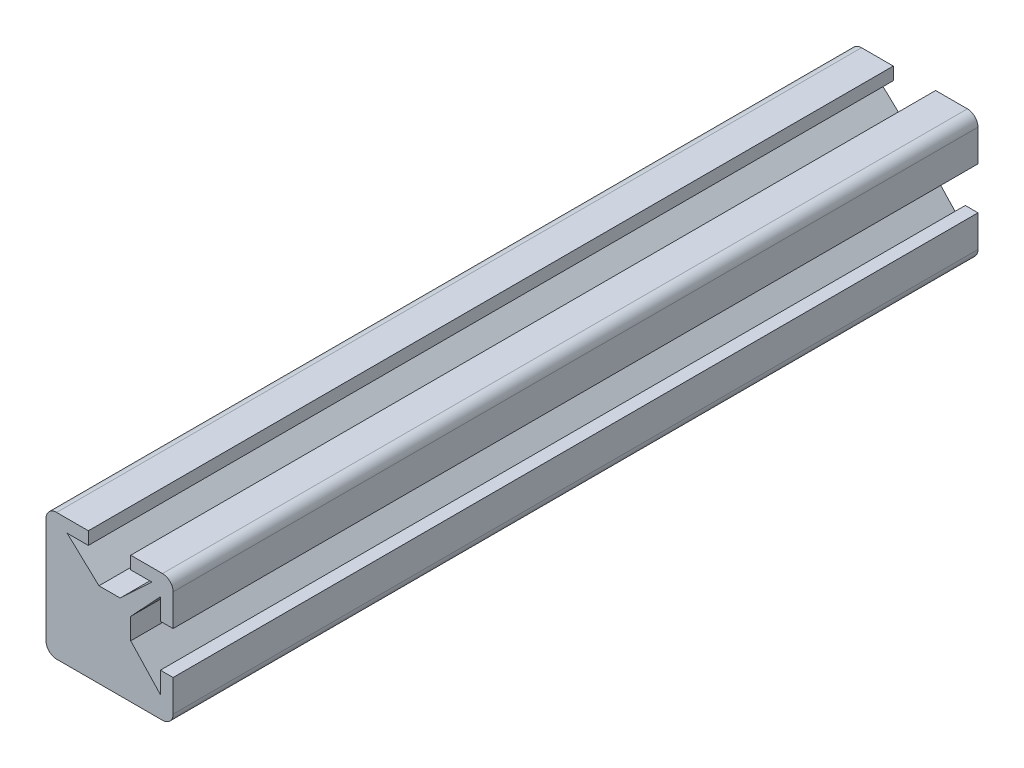
ISO-10303-21;
HEADER;
FILE_DESCRIPTION(('STEP AP214'),'2;1');
FILE_NAME('part.step','',(''),(''),'','','');
FILE_SCHEMA(('AUTOMOTIVE_DESIGN { 1 0 10303 214 1 1 1 1 }'));
ENDSEC;
DATA;
#1=APPLICATION_CONTEXT('core data for automotive mechanical design processes');
#2=APPLICATION_PROTOCOL_DEFINITION('international standard','automotive_design',2000,#1);
#3=PRODUCT_CONTEXT('',#1,'mechanical');
#4=PRODUCT('Part','Part','',(#3));
#5=PRODUCT_RELATED_PRODUCT_CATEGORY('part','',(#4));
#6=PRODUCT_DEFINITION_FORMATION('','',#4);
#7=PRODUCT_DEFINITION_CONTEXT('part definition',#1,'design');
#8=PRODUCT_DEFINITION('design','',#6,#7);
#9=PRODUCT_DEFINITION_SHAPE('','',#8);
#10=(LENGTH_UNIT() NAMED_UNIT(*) SI_UNIT(.MILLI.,.METRE.));
#11=(NAMED_UNIT(*) PLANE_ANGLE_UNIT() SI_UNIT($,.RADIAN.));
#12=(NAMED_UNIT(*) SI_UNIT($,.STERADIAN.) SOLID_ANGLE_UNIT());
#13=UNCERTAINTY_MEASURE_WITH_UNIT(LENGTH_MEASURE(1.E-05),#10,'distance_accuracy_value','');
#14=(GEOMETRIC_REPRESENTATION_CONTEXT(3) GLOBAL_UNCERTAINTY_ASSIGNED_CONTEXT((#13)) GLOBAL_UNIT_ASSIGNED_CONTEXT((#10,
#11,#12)) REPRESENTATION_CONTEXT('',''));
#15=CARTESIAN_POINT('',(0.,0.,0.));
#16=DIRECTION('',(0.,0.,1.));
#17=DIRECTION('',(1.,0.,0.));
#18=AXIS2_PLACEMENT_3D('',#15,#16,#17);
#19=CARTESIAN_POINT('',(-5.,6.,38.));
#20=DIRECTION('',(0.,-1.,0.));
#21=DIRECTION('',(0.,0.,-1.));
#22=AXIS2_PLACEMENT_3D('',#19,#20,#21);
#23=PLANE('',#22);
#24=DIRECTION('',(-1.,0.,0.));
#25=VECTOR('',#24,1.);
#26=CARTESIAN_POINT('',(-5.,6.,-38.));
#27=LINE('',#26,#25);
#28=CARTESIAN_POINT('',(5.,6.,-38.));
#29=VERTEX_POINT('',#28);
#30=CARTESIAN_POINT('',(1.99999999999998,6.00000000000001,-38.));
#31=VERTEX_POINT('',#30);
#32=EDGE_CURVE('E217',#29,#31,#27,.T.);
#33=ORIENTED_EDGE('',*,*,#32,.T.);
#34=DIRECTION('',(0.,0.,1.));
#35=VECTOR('',#34,1.);
#36=CARTESIAN_POINT('',(1.99999999999998,6.00000000000001,-38.));
#37=LINE('',#36,#35);
#38=CARTESIAN_POINT('',(1.99999999999998,6.00000000000001,38.));
#39=VERTEX_POINT('',#38);
#40=EDGE_CURVE('E385',#31,#39,#37,.T.);
#41=ORIENTED_EDGE('',*,*,#40,.T.);
#42=DIRECTION('',(-1.,0.,0.));
#43=VECTOR('',#42,1.);
#44=CARTESIAN_POINT('',(-5.,6.,38.));
#45=LINE('',#44,#43);
#46=CARTESIAN_POINT('',(5.,6.,38.));
#47=VERTEX_POINT('',#46);
#48=EDGE_CURVE('E282',#47,#39,#45,.T.);
#49=ORIENTED_EDGE('',*,*,#48,.F.);
#50=DIRECTION('',(0.,0.,-1.));
#51=VECTOR('',#50,1.);
#52=CARTESIAN_POINT('',(5.,6.,38.));
#53=LINE('',#52,#51);
#54=EDGE_CURVE('E238',#47,#29,#53,.T.);
#55=ORIENTED_EDGE('',*,*,#54,.T.);
#56=EDGE_LOOP('',(#33,#41,#49,#55));
#57=FACE_BOUND('',#56,.T.);
#58=ADVANCED_FACE('F32',(#57),#23,.F.);
#59=CARTESIAN_POINT('',(6.,5.,38.));
#60=DIRECTION('',(-1.,0.,0.));
#61=DIRECTION('',(0.,0.,1.));
#62=AXIS2_PLACEMENT_3D('',#59,#60,#61);
#63=PLANE('',#62);
#64=DIRECTION('',(0.,1.,0.));
#65=VECTOR('',#64,1.);
#66=CARTESIAN_POINT('',(6.,5.,-38.));
#67=LINE('',#66,#65);
#68=CARTESIAN_POINT('',(6.,-5.,-38.));
#69=VERTEX_POINT('',#68);
#70=CARTESIAN_POINT('',(6.,-2.,-38.));
#71=VERTEX_POINT('',#70);
#72=EDGE_CURVE('E221',#69,#71,#67,.T.);
#73=ORIENTED_EDGE('',*,*,#72,.T.);
#74=DIRECTION('',(0.,0.,1.));
#75=VECTOR('',#74,1.);
#76=CARTESIAN_POINT('',(6.,-2.,-38.));
#77=LINE('',#76,#75);
#78=CARTESIAN_POINT('',(6.,-2.,38.));
#79=VERTEX_POINT('',#78);
#80=EDGE_CURVE('E270',#71,#79,#77,.T.);
#81=ORIENTED_EDGE('',*,*,#80,.T.);
#82=DIRECTION('',(0.,1.,0.));
#83=VECTOR('',#82,1.);
#84=CARTESIAN_POINT('',(6.,5.,38.));
#85=LINE('',#84,#83);
#86=CARTESIAN_POINT('',(6.,-5.,38.));
#87=VERTEX_POINT('',#86);
#88=EDGE_CURVE('E272',#87,#79,#85,.T.);
#89=ORIENTED_EDGE('',*,*,#88,.F.);
#90=DIRECTION('',(0.,0.,-1.));
#91=VECTOR('',#90,1.);
#92=CARTESIAN_POINT('',(6.,-5.,38.));
#93=LINE('',#92,#91);
#94=EDGE_CURVE('E244',#87,#69,#93,.T.);
#95=ORIENTED_EDGE('',*,*,#94,.T.);
#96=EDGE_LOOP('',(#73,#81,#89,#95));
#97=FACE_BOUND('',#96,.T.);
#98=ADVANCED_FACE('F268',(#97),#63,.F.);
#99=CARTESIAN_POINT('',(-5.,-5.,38.));
#100=DIRECTION('',(0.,0.,-1.));
#101=DIRECTION('',(-1.,0.,0.));
#102=AXIS2_PLACEMENT_3D('',#99,#100,#101);
#103=CYLINDRICAL_SURFACE('',#102,1.);
#104=CARTESIAN_POINT('',(-5.,-5.,-38.));
#105=DIRECTION('',(0.,0.,1.));
#106=DIRECTION('',(-1.,0.,0.));
#107=AXIS2_PLACEMENT_3D('',#104,#105,#106);
#108=CIRCLE('',#107,1.);
#109=CARTESIAN_POINT('',(-6.,-5.,-38.));
#110=VERTEX_POINT('',#109);
#111=CARTESIAN_POINT('',(-5.,-6.,-38.));
#112=VERTEX_POINT('',#111);
#113=EDGE_CURVE('E263',#110,#112,#108,.T.);
#114=ORIENTED_EDGE('',*,*,#113,.T.);
#115=DIRECTION('',(0.,0.,-1.));
#116=VECTOR('',#115,1.);
#117=CARTESIAN_POINT('',(-5.,-6.,38.));
#118=LINE('',#117,#116);
#119=CARTESIAN_POINT('',(-5.,-6.,38.));
#120=VERTEX_POINT('',#119);
#121=EDGE_CURVE('E11',#120,#112,#118,.T.);
#122=ORIENTED_EDGE('',*,*,#121,.F.);
#123=CARTESIAN_POINT('',(-5.,-5.,38.));
#124=DIRECTION('',(0.,0.,1.));
#125=DIRECTION('',(-1.,0.,0.));
#126=AXIS2_PLACEMENT_3D('',#123,#124,#125);
#127=CIRCLE('',#126,1.);
#128=CARTESIAN_POINT('',(-6.,-5.,38.));
#129=VERTEX_POINT('',#128);
#130=EDGE_CURVE('E228',#129,#120,#127,.T.);
#131=ORIENTED_EDGE('',*,*,#130,.F.);
#132=DIRECTION('',(0.,0.,-1.));
#133=VECTOR('',#132,1.);
#134=CARTESIAN_POINT('',(-6.,-5.,38.));
#135=LINE('',#134,#133);
#136=EDGE_CURVE('E229',#129,#110,#135,.T.);
#137=ORIENTED_EDGE('',*,*,#136,.T.);
#138=EDGE_LOOP('',(#114,#122,#131,#137));
#139=FACE_BOUND('',#138,.T.);
#140=ADVANCED_FACE('F34',(#139),#103,.T.);
#141=CARTESIAN_POINT('',(-5.,-6.,38.));
#142=DIRECTION('',(0.,1.,0.));
#143=DIRECTION('',(-1.,0.,0.));
#144=AXIS2_PLACEMENT_3D('',#141,#142,#143);
#145=PLANE('',#144);
#146=DIRECTION('',(1.,0.,0.));
#147=VECTOR('',#146,1.);
#148=CARTESIAN_POINT('',(-5.,-6.,-38.));
#149=LINE('',#148,#147);
#150=CARTESIAN_POINT('',(5.,-6.,-38.));
#151=VERTEX_POINT('',#150);
#152=EDGE_CURVE('E258',#112,#151,#149,.T.);
#153=ORIENTED_EDGE('',*,*,#152,.T.);
#154=DIRECTION('',(0.,0.,-1.));
#155=VECTOR('',#154,1.);
#156=CARTESIAN_POINT('',(5.,-6.,38.));
#157=LINE('',#156,#155);
#158=CARTESIAN_POINT('',(5.,-6.,38.));
#159=VERTEX_POINT('',#158);
#160=EDGE_CURVE('E40',#159,#151,#157,.T.);
#161=ORIENTED_EDGE('',*,*,#160,.F.);
#162=DIRECTION('',(1.,0.,0.));
#163=VECTOR('',#162,1.);
#164=CARTESIAN_POINT('',(-5.,-6.,38.));
#165=LINE('',#164,#163);
#166=EDGE_CURVE('E311',#120,#159,#165,.T.);
#167=ORIENTED_EDGE('',*,*,#166,.F.);
#168=ORIENTED_EDGE('',*,*,#121,.T.);
#169=EDGE_LOOP('',(#153,#161,#167,#168));
#170=FACE_BOUND('',#169,.T.);
#171=ADVANCED_FACE('F352',(#170),#145,.F.);
#172=CARTESIAN_POINT('',(5.,-5.,38.));
#173=DIRECTION('',(0.,0.,-1.));
#174=DIRECTION('',(-1.,0.,0.));
#175=AXIS2_PLACEMENT_3D('',#172,#173,#174);
#176=CYLINDRICAL_SURFACE('',#175,1.);
#177=CARTESIAN_POINT('',(5.,-5.,-38.));
#178=DIRECTION('',(0.,0.,1.));
#179=DIRECTION('',(-1.,0.,0.));
#180=AXIS2_PLACEMENT_3D('',#177,#178,#179);
#181=CIRCLE('',#180,1.);
#182=EDGE_CURVE('E253',#151,#69,#181,.T.);
#183=ORIENTED_EDGE('',*,*,#182,.T.);
#184=ORIENTED_EDGE('',*,*,#94,.F.);
#185=CARTESIAN_POINT('',(5.,-5.,38.));
#186=DIRECTION('',(0.,0.,1.));
#187=DIRECTION('',(-1.,0.,0.));
#188=AXIS2_PLACEMENT_3D('',#185,#186,#187);
#189=CIRCLE('',#188,1.);
#190=EDGE_CURVE('E254',#159,#87,#189,.T.);
#191=ORIENTED_EDGE('',*,*,#190,.F.);
#192=ORIENTED_EDGE('',*,*,#160,.T.);
#193=EDGE_LOOP('',(#183,#184,#191,#192));
#194=FACE_BOUND('',#193,.T.);
#195=ADVANCED_FACE('F251',(#194),#176,.T.);
#196=CARTESIAN_POINT('',(6.,2.,38.));
#197=VERTEX_POINT('',#196);
#198=CARTESIAN_POINT('',(6.,5.,38.));
#199=VERTEX_POINT('',#198);
#200=EDGE_CURVE('E276',#197,#199,#85,.T.);
#201=ORIENTED_EDGE('',*,*,#200,.F.);
#202=DIRECTION('',(0.,0.,1.));
#203=VECTOR('',#202,1.);
#204=CARTESIAN_POINT('',(6.,2.,-38.));
#205=LINE('',#204,#203);
#206=CARTESIAN_POINT('',(6.,2.,-38.));
#207=VERTEX_POINT('',#206);
#208=EDGE_CURVE('E307',#207,#197,#205,.T.);
#209=ORIENTED_EDGE('',*,*,#208,.F.);
#210=CARTESIAN_POINT('',(6.,5.,-38.));
#211=VERTEX_POINT('',#210);
#212=EDGE_CURVE('E261',#207,#211,#67,.T.);
#213=ORIENTED_EDGE('',*,*,#212,.T.);
#214=DIRECTION('',(0.,0.,-1.));
#215=VECTOR('',#214,1.);
#216=CARTESIAN_POINT('',(6.,5.,38.));
#217=LINE('',#216,#215);
#218=EDGE_CURVE('E241',#199,#211,#217,.T.);
#219=ORIENTED_EDGE('',*,*,#218,.F.);
#220=EDGE_LOOP('',(#201,#209,#213,#219));
#221=FACE_BOUND('',#220,.T.);
#222=ADVANCED_FACE('F335',(#221),#63,.F.);
#223=CARTESIAN_POINT('',(5.,5.,38.));
#224=DIRECTION('',(0.,0.,-1.));
#225=DIRECTION('',(-1.,0.,0.));
#226=AXIS2_PLACEMENT_3D('',#223,#224,#225);
#227=CYLINDRICAL_SURFACE('',#226,1.);
#228=CARTESIAN_POINT('',(5.,5.,-38.));
#229=DIRECTION('',(0.,0.,1.));
#230=DIRECTION('',(-1.,0.,0.));
#231=AXIS2_PLACEMENT_3D('',#228,#229,#230);
#232=CIRCLE('',#231,1.);
#233=EDGE_CURVE('E218',#211,#29,#232,.T.);
#234=ORIENTED_EDGE('',*,*,#233,.T.);
#235=ORIENTED_EDGE('',*,*,#54,.F.);
#236=CARTESIAN_POINT('',(5.,5.,38.));
#237=DIRECTION('',(0.,0.,1.));
#238=DIRECTION('',(-1.,0.,0.));
#239=AXIS2_PLACEMENT_3D('',#236,#237,#238);
#240=CIRCLE('',#239,1.);
#241=EDGE_CURVE('E275',#199,#47,#240,.T.);
#242=ORIENTED_EDGE('',*,*,#241,.F.);
#243=ORIENTED_EDGE('',*,*,#218,.T.);
#244=EDGE_LOOP('',(#234,#235,#242,#243));
#245=FACE_BOUND('',#244,.T.);
#246=ADVANCED_FACE('F339',(#245),#227,.T.);
#247=CARTESIAN_POINT('',(-2.00000000000002,6.,38.));
#248=VERTEX_POINT('',#247);
#249=CARTESIAN_POINT('',(-5.,6.,38.));
#250=VERTEX_POINT('',#249);
#251=EDGE_CURVE('E209',#248,#250,#45,.T.);
#252=ORIENTED_EDGE('',*,*,#251,.F.);
#253=DIRECTION('',(0.,0.,1.));
#254=VECTOR('',#253,1.);
#255=CARTESIAN_POINT('',(-2.00000000000002,6.,-38.));
#256=LINE('',#255,#254);
#257=CARTESIAN_POINT('',(-2.00000000000002,6.,-38.));
#258=VERTEX_POINT('',#257);
#259=EDGE_CURVE('E196',#258,#248,#256,.T.);
#260=ORIENTED_EDGE('',*,*,#259,.F.);
#261=CARTESIAN_POINT('',(-5.,6.,-38.));
#262=VERTEX_POINT('',#261);
#263=EDGE_CURVE('E207',#258,#262,#27,.T.);
#264=ORIENTED_EDGE('',*,*,#263,.T.);
#265=DIRECTION('',(0.,0.,-1.));
#266=VECTOR('',#265,1.);
#267=CARTESIAN_POINT('',(-5.,6.,38.));
#268=LINE('',#267,#266);
#269=EDGE_CURVE('E236',#250,#262,#268,.T.);
#270=ORIENTED_EDGE('',*,*,#269,.F.);
#271=EDGE_LOOP('',(#252,#260,#264,#270));
#272=FACE_BOUND('',#271,.T.);
#273=ADVANCED_FACE('F205',(#272),#23,.F.);
#274=CARTESIAN_POINT('',(-5.,5.,38.));
#275=DIRECTION('',(0.,0.,-1.));
#276=DIRECTION('',(-1.,0.,0.));
#277=AXIS2_PLACEMENT_3D('',#274,#275,#276);
#278=CYLINDRICAL_SURFACE('',#277,1.);
#279=CARTESIAN_POINT('',(-5.,5.,-38.));
#280=DIRECTION('',(0.,0.,1.));
#281=DIRECTION('',(1.,0.,0.));
#282=AXIS2_PLACEMENT_3D('',#279,#280,#281);
#283=CIRCLE('',#282,1.);
#284=CARTESIAN_POINT('',(-6.,5.,-38.));
#285=VERTEX_POINT('',#284);
#286=EDGE_CURVE('E216',#262,#285,#283,.T.);
#287=ORIENTED_EDGE('',*,*,#286,.T.);
#288=DIRECTION('',(0.,0.,-1.));
#289=VECTOR('',#288,1.);
#290=CARTESIAN_POINT('',(-6.,5.,38.));
#291=LINE('',#290,#289);
#292=CARTESIAN_POINT('',(-6.,5.,38.));
#293=VERTEX_POINT('',#292);
#294=EDGE_CURVE('E232',#293,#285,#291,.T.);
#295=ORIENTED_EDGE('',*,*,#294,.F.);
#296=CARTESIAN_POINT('',(-5.,5.,38.));
#297=DIRECTION('',(0.,0.,1.));
#298=DIRECTION('',(1.,0.,0.));
#299=AXIS2_PLACEMENT_3D('',#296,#297,#298);
#300=CIRCLE('',#299,1.);
#301=EDGE_CURVE('E285',#250,#293,#300,.T.);
#302=ORIENTED_EDGE('',*,*,#301,.F.);
#303=ORIENTED_EDGE('',*,*,#269,.T.);
#304=EDGE_LOOP('',(#287,#295,#302,#303));
#305=FACE_BOUND('',#304,.T.);
#306=ADVANCED_FACE('F324',(#305),#278,.T.);
#307=CARTESIAN_POINT('',(-6.,5.,38.));
#308=DIRECTION('',(1.,0.,0.));
#309=DIRECTION('',(0.,1.,0.));
#310=AXIS2_PLACEMENT_3D('',#307,#308,#309);
#311=PLANE('',#310);
#312=DIRECTION('',(0.,-1.,0.));
#313=VECTOR('',#312,1.);
#314=CARTESIAN_POINT('',(-6.,5.,-38.));
#315=LINE('',#314,#313);
#316=EDGE_CURVE('E226',#285,#110,#315,.T.);
#317=ORIENTED_EDGE('',*,*,#316,.T.);
#318=ORIENTED_EDGE('',*,*,#136,.F.);
#319=DIRECTION('',(0.,-1.,0.));
#320=VECTOR('',#319,1.);
#321=CARTESIAN_POINT('',(-6.,5.,38.));
#322=LINE('',#321,#320);
#323=EDGE_CURVE('E233',#293,#129,#322,.T.);
#324=ORIENTED_EDGE('',*,*,#323,.F.);
#325=ORIENTED_EDGE('',*,*,#294,.T.);
#326=EDGE_LOOP('',(#317,#318,#324,#325));
#327=FACE_BOUND('',#326,.T.);
#328=ADVANCED_FACE('F316',(#327),#311,.F.);
#329=CARTESIAN_POINT('',(-5.,-5.,38.));
#330=DIRECTION('',(0.,0.,-1.));
#331=DIRECTION('',(-1.,0.,0.));
#332=AXIS2_PLACEMENT_3D('',#329,#330,#331);
#333=PLANE('',#332);
#334=ORIENTED_EDGE('',*,*,#48,.T.);
#335=DIRECTION('',(0.,1.,0.));
#336=VECTOR('',#335,1.);
#337=CARTESIAN_POINT('',(1.99999999999998,4.80000000000001,38.));
#338=LINE('',#337,#336);
#339=CARTESIAN_POINT('',(1.99999999999998,4.80000000000001,38.));
#340=VERTEX_POINT('',#339);
#341=EDGE_CURVE('E201',#340,#39,#338,.T.);
#342=ORIENTED_EDGE('',*,*,#341,.F.);
#343=DIRECTION('',(-1.,0.,0.));
#344=VECTOR('',#343,1.);
#345=CARTESIAN_POINT('',(3.99999999999998,4.80000000000002,38.));
#346=LINE('',#345,#344);
#347=CARTESIAN_POINT('',(3.99999999999998,4.80000000000002,38.));
#348=VERTEX_POINT('',#347);
#349=EDGE_CURVE('E381',#348,#340,#346,.T.);
#350=ORIENTED_EDGE('',*,*,#349,.F.);
#351=DIRECTION('',(0.731055268242867,0.682318250360014,0.));
#352=VECTOR('',#351,1.);
#353=CARTESIAN_POINT('',(3.99999999999998,4.80000000000002,38.));
#354=LINE('',#353,#352);
#355=CARTESIAN_POINT('',(0.999999999999993,2.,38.));
#356=VERTEX_POINT('',#355);
#357=EDGE_CURVE('E378',#356,#348,#354,.T.);
#358=ORIENTED_EDGE('',*,*,#357,.F.);
#359=DIRECTION('',(1.,0.,0.));
#360=VECTOR('',#359,1.);
#361=CARTESIAN_POINT('',(-1.00000000000001,2.,38.));
#362=LINE('',#361,#360);
#363=CARTESIAN_POINT('',(-1.00000000000001,2.,38.));
#364=VERTEX_POINT('',#363);
#365=EDGE_CURVE('E375',#364,#356,#362,.T.);
#366=ORIENTED_EDGE('',*,*,#365,.F.);
#367=DIRECTION('',(0.731055268242871,-0.682318250360009,0.));
#368=VECTOR('',#367,1.);
#369=CARTESIAN_POINT('',(-4.00000000000002,4.79999999999999,38.));
#370=LINE('',#369,#368);
#371=CARTESIAN_POINT('',(-4.00000000000002,4.79999999999999,38.));
#372=VERTEX_POINT('',#371);
#373=EDGE_CURVE('E368',#372,#364,#370,.T.);
#374=ORIENTED_EDGE('',*,*,#373,.F.);
#375=DIRECTION('',(-1.,0.,0.));
#376=VECTOR('',#375,1.);
#377=CARTESIAN_POINT('',(-2.00000000000002,4.8,38.));
#378=LINE('',#377,#376);
#379=CARTESIAN_POINT('',(-2.00000000000002,4.8,38.));
#380=VERTEX_POINT('',#379);
#381=EDGE_CURVE('E366',#380,#372,#378,.T.);
#382=ORIENTED_EDGE('',*,*,#381,.F.);
#383=DIRECTION('',(0.,-1.,0.));
#384=VECTOR('',#383,1.);
#385=CARTESIAN_POINT('',(-2.00000000000002,6.,38.));
#386=LINE('',#385,#384);
#387=EDGE_CURVE('E363',#248,#380,#386,.T.);
#388=ORIENTED_EDGE('',*,*,#387,.F.);
#389=ORIENTED_EDGE('',*,*,#251,.T.);
#390=ORIENTED_EDGE('',*,*,#301,.T.);
#391=ORIENTED_EDGE('',*,*,#323,.T.);
#392=ORIENTED_EDGE('',*,*,#130,.T.);
#393=ORIENTED_EDGE('',*,*,#166,.T.);
#394=ORIENTED_EDGE('',*,*,#190,.T.);
#395=ORIENTED_EDGE('',*,*,#88,.T.);
#396=DIRECTION('',(1.,0.,0.));
#397=VECTOR('',#396,1.);
#398=CARTESIAN_POINT('',(4.8,-2.,38.));
#399=LINE('',#398,#397);
#400=CARTESIAN_POINT('',(4.8,-2.,38.));
#401=VERTEX_POINT('',#400);
#402=EDGE_CURVE('E295',#401,#79,#399,.T.);
#403=ORIENTED_EDGE('',*,*,#402,.F.);
#404=DIRECTION('',(0.,1.,0.));
#405=VECTOR('',#404,1.);
#406=CARTESIAN_POINT('',(4.8,-4.,38.));
#407=LINE('',#406,#405);
#408=CARTESIAN_POINT('',(4.8,-4.,38.));
#409=VERTEX_POINT('',#408);
#410=EDGE_CURVE('E430',#409,#401,#407,.T.);
#411=ORIENTED_EDGE('',*,*,#410,.F.);
#412=DIRECTION('',(0.682318250360011,-0.731055268242869,0.));
#413=VECTOR('',#412,1.);
#414=CARTESIAN_POINT('',(4.8,-4.,38.));
#415=LINE('',#414,#413);
#416=CARTESIAN_POINT('',(2.,-1.,38.));
#417=VERTEX_POINT('',#416);
#418=EDGE_CURVE('E428',#417,#409,#415,.T.);
#419=ORIENTED_EDGE('',*,*,#418,.F.);
#420=DIRECTION('',(0.,-1.,0.));
#421=VECTOR('',#420,1.);
#422=CARTESIAN_POINT('',(2.,1.,38.));
#423=LINE('',#422,#421);
#424=CARTESIAN_POINT('',(2.,1.,38.));
#425=VERTEX_POINT('',#424);
#426=EDGE_CURVE('E425',#425,#417,#423,.T.);
#427=ORIENTED_EDGE('',*,*,#426,.F.);
#428=DIRECTION('',(-0.682318250360011,-0.731055268242869,0.));
#429=VECTOR('',#428,1.);
#430=CARTESIAN_POINT('',(4.8,4.,38.));
#431=LINE('',#430,#429);
#432=CARTESIAN_POINT('',(4.8,4.,38.));
#433=VERTEX_POINT('',#432);
#434=EDGE_CURVE('E422',#433,#425,#431,.T.);
#435=ORIENTED_EDGE('',*,*,#434,.F.);
#436=DIRECTION('',(0.,1.,0.));
#437=VECTOR('',#436,1.);
#438=CARTESIAN_POINT('',(4.8,2.,38.));
#439=LINE('',#438,#437);
#440=CARTESIAN_POINT('',(4.8,2.,38.));
#441=VERTEX_POINT('',#440);
#442=EDGE_CURVE('E419',#441,#433,#439,.T.);
#443=ORIENTED_EDGE('',*,*,#442,.F.);
#444=DIRECTION('',(-1.,0.,0.));
#445=VECTOR('',#444,1.);
#446=CARTESIAN_POINT('',(6.,2.,38.));
#447=LINE('',#446,#445);
#448=EDGE_CURVE('E388',#197,#441,#447,.T.);
#449=ORIENTED_EDGE('',*,*,#448,.F.);
#450=ORIENTED_EDGE('',*,*,#200,.T.);
#451=ORIENTED_EDGE('',*,*,#241,.T.);
#452=EDGE_LOOP('',(#334,#342,#350,#358,#366,#374,#382,#388,#389,#390,#391,#392,#393,#394,#395,
#403,#411,#419,#427,#435,#443,#449,#450,#451));
#453=FACE_BOUND('',#452,.T.);
#454=ADVANCED_FACE('F312',(#453),#333,.F.);
#455=CARTESIAN_POINT('',(-5.,-5.,-38.));
#456=DIRECTION('',(0.,0.,-1.));
#457=DIRECTION('',(-1.,0.,0.));
#458=AXIS2_PLACEMENT_3D('',#455,#456,#457);
#459=PLANE('',#458);
#460=DIRECTION('',(0.,1.,0.));
#461=VECTOR('',#460,1.);
#462=CARTESIAN_POINT('',(1.99999999999998,4.80000000000001,-38.));
#463=LINE('',#462,#461);
#464=CARTESIAN_POINT('',(1.99999999999998,4.80000000000001,-38.));
#465=VERTEX_POINT('',#464);
#466=EDGE_CURVE('E210',#465,#31,#463,.T.);
#467=ORIENTED_EDGE('',*,*,#466,.T.);
#468=ORIENTED_EDGE('',*,*,#32,.F.);
#469=ORIENTED_EDGE('',*,*,#233,.F.);
#470=ORIENTED_EDGE('',*,*,#212,.F.);
#471=DIRECTION('',(-1.,0.,0.));
#472=VECTOR('',#471,1.);
#473=CARTESIAN_POINT('',(6.,2.,-38.));
#474=LINE('',#473,#472);
#475=CARTESIAN_POINT('',(4.8,2.,-38.));
#476=VERTEX_POINT('',#475);
#477=EDGE_CURVE('E400',#207,#476,#474,.T.);
#478=ORIENTED_EDGE('',*,*,#477,.T.);
#479=DIRECTION('',(0.,1.,0.));
#480=VECTOR('',#479,1.);
#481=CARTESIAN_POINT('',(4.8,2.,-38.));
#482=LINE('',#481,#480);
#483=CARTESIAN_POINT('',(4.8,4.,-38.));
#484=VERTEX_POINT('',#483);
#485=EDGE_CURVE('E55',#476,#484,#482,.T.);
#486=ORIENTED_EDGE('',*,*,#485,.T.);
#487=DIRECTION('',(-0.682318250360011,-0.731055268242869,0.));
#488=VECTOR('',#487,1.);
#489=CARTESIAN_POINT('',(4.8,4.,-38.));
#490=LINE('',#489,#488);
#491=CARTESIAN_POINT('',(2.,1.,-38.));
#492=VERTEX_POINT('',#491);
#493=EDGE_CURVE('E404',#484,#492,#490,.T.);
#494=ORIENTED_EDGE('',*,*,#493,.T.);
#495=DIRECTION('',(0.,-1.,0.));
#496=VECTOR('',#495,1.);
#497=CARTESIAN_POINT('',(2.,1.,-38.));
#498=LINE('',#497,#496);
#499=CARTESIAN_POINT('',(2.,-1.,-38.));
#500=VERTEX_POINT('',#499);
#501=EDGE_CURVE('E407',#492,#500,#498,.T.);
#502=ORIENTED_EDGE('',*,*,#501,.T.);
#503=DIRECTION('',(0.682318250360011,-0.731055268242869,0.));
#504=VECTOR('',#503,1.);
#505=CARTESIAN_POINT('',(4.8,-4.,-38.));
#506=LINE('',#505,#504);
#507=CARTESIAN_POINT('',(4.8,-4.,-38.));
#508=VERTEX_POINT('',#507);
#509=EDGE_CURVE('E410',#500,#508,#506,.T.);
#510=ORIENTED_EDGE('',*,*,#509,.T.);
#511=DIRECTION('',(0.,1.,0.));
#512=VECTOR('',#511,1.);
#513=CARTESIAN_POINT('',(4.8,-4.,-38.));
#514=LINE('',#513,#512);
#515=CARTESIAN_POINT('',(4.8,-2.,-38.));
#516=VERTEX_POINT('',#515);
#517=EDGE_CURVE('E413',#508,#516,#514,.T.);
#518=ORIENTED_EDGE('',*,*,#517,.T.);
#519=DIRECTION('',(1.,0.,0.));
#520=VECTOR('',#519,1.);
#521=CARTESIAN_POINT('',(4.8,-2.,-38.));
#522=LINE('',#521,#520);
#523=EDGE_CURVE('E309',#516,#71,#522,.T.);
#524=ORIENTED_EDGE('',*,*,#523,.T.);
#525=ORIENTED_EDGE('',*,*,#72,.F.);
#526=ORIENTED_EDGE('',*,*,#182,.F.);
#527=ORIENTED_EDGE('',*,*,#152,.F.);
#528=ORIENTED_EDGE('',*,*,#113,.F.);
#529=ORIENTED_EDGE('',*,*,#316,.F.);
#530=ORIENTED_EDGE('',*,*,#286,.F.);
#531=ORIENTED_EDGE('',*,*,#263,.F.);
#532=DIRECTION('',(0.,-1.,0.));
#533=VECTOR('',#532,1.);
#534=CARTESIAN_POINT('',(-2.00000000000002,6.,-38.));
#535=LINE('',#534,#533);
#536=CARTESIAN_POINT('',(-2.00000000000002,4.8,-38.));
#537=VERTEX_POINT('',#536);
#538=EDGE_CURVE('E192',#258,#537,#535,.T.);
#539=ORIENTED_EDGE('',*,*,#538,.T.);
#540=DIRECTION('',(-1.,0.,0.));
#541=VECTOR('',#540,1.);
#542=CARTESIAN_POINT('',(-2.00000000000002,4.8,-38.));
#543=LINE('',#542,#541);
#544=CARTESIAN_POINT('',(-4.00000000000002,4.79999999999999,-38.));
#545=VERTEX_POINT('',#544);
#546=EDGE_CURVE('E47',#537,#545,#543,.T.);
#547=ORIENTED_EDGE('',*,*,#546,.T.);
#548=DIRECTION('',(0.731055268242871,-0.682318250360009,0.));
#549=VECTOR('',#548,1.);
#550=CARTESIAN_POINT('',(-4.00000000000002,4.79999999999999,-38.));
#551=LINE('',#550,#549);
#552=CARTESIAN_POINT('',(-1.00000000000001,2.,-38.));
#553=VERTEX_POINT('',#552);
#554=EDGE_CURVE('E475',#545,#553,#551,.T.);
#555=ORIENTED_EDGE('',*,*,#554,.T.);
#556=DIRECTION('',(1.,0.,0.));
#557=VECTOR('',#556,1.);
#558=CARTESIAN_POINT('',(-1.00000000000001,2.,-38.));
#559=LINE('',#558,#557);
#560=CARTESIAN_POINT('',(0.999999999999993,2.,-38.));
#561=VERTEX_POINT('',#560);
#562=EDGE_CURVE('E470',#553,#561,#559,.T.);
#563=ORIENTED_EDGE('',*,*,#562,.T.);
#564=DIRECTION('',(0.731055268242867,0.682318250360014,0.));
#565=VECTOR('',#564,1.);
#566=CARTESIAN_POINT('',(3.99999999999998,4.80000000000002,-38.));
#567=LINE('',#566,#565);
#568=CARTESIAN_POINT('',(3.99999999999998,4.80000000000002,-38.));
#569=VERTEX_POINT('',#568);
#570=EDGE_CURVE('E469',#561,#569,#567,.T.);
#571=ORIENTED_EDGE('',*,*,#570,.T.);
#572=DIRECTION('',(-1.,0.,0.));
#573=VECTOR('',#572,1.);
#574=CARTESIAN_POINT('',(3.99999999999998,4.80000000000002,-38.));
#575=LINE('',#574,#573);
#576=EDGE_CURVE('E468',#569,#465,#575,.T.);
#577=ORIENTED_EDGE('',*,*,#576,.T.);
#578=EDGE_LOOP('',(#467,#468,#469,#470,#478,#486,#494,#502,#510,#518,#524,#525,#526,#527,#528,
#529,#530,#531,#539,#547,#555,#563,#571,#577));
#579=FACE_BOUND('',#578,.T.);
#580=ADVANCED_FACE('F214',(#579),#459,.T.);
#581=CARTESIAN_POINT('',(4.8,-2.,-38.));
#582=DIRECTION('',(0.,-1.,0.));
#583=DIRECTION('',(0.,0.,-1.));
#584=AXIS2_PLACEMENT_3D('',#581,#582,#583);
#585=PLANE('',#584);
#586=ORIENTED_EDGE('',*,*,#402,.T.);
#587=ORIENTED_EDGE('',*,*,#80,.F.);
#588=ORIENTED_EDGE('',*,*,#523,.F.);
#589=DIRECTION('',(0.,0.,1.));
#590=VECTOR('',#589,1.);
#591=CARTESIAN_POINT('',(4.8,-2.,-38.));
#592=LINE('',#591,#590);
#593=EDGE_CURVE('E290',#516,#401,#592,.T.);
#594=ORIENTED_EDGE('',*,*,#593,.T.);
#595=EDGE_LOOP('',(#586,#587,#588,#594));
#596=FACE_BOUND('',#595,.T.);
#597=ADVANCED_FACE('F322',(#596),#585,.F.);
#598=CARTESIAN_POINT('',(4.8,-4.,-38.));
#599=DIRECTION('',(1.,0.,0.));
#600=DIRECTION('',(0.,0.,-1.));
#601=AXIS2_PLACEMENT_3D('',#598,#599,#600);
#602=PLANE('',#601);
#603=ORIENTED_EDGE('',*,*,#410,.T.);
#604=ORIENTED_EDGE('',*,*,#593,.F.);
#605=ORIENTED_EDGE('',*,*,#517,.F.);
#606=DIRECTION('',(0.,0.,1.));
#607=VECTOR('',#606,1.);
#608=CARTESIAN_POINT('',(4.8,-4.,-38.));
#609=LINE('',#608,#607);
#610=EDGE_CURVE('E292',#508,#409,#609,.T.);
#611=ORIENTED_EDGE('',*,*,#610,.T.);
#612=EDGE_LOOP('',(#603,#604,#605,#611));
#613=FACE_BOUND('',#612,.T.);
#614=ADVANCED_FACE('F512',(#613),#602,.F.);
#615=CARTESIAN_POINT('',(4.8,-4.,-38.));
#616=DIRECTION('',(-0.731055268242869,-0.682318250360011,0.));
#617=DIRECTION('',(0.682318250360011,-0.731055268242869,0.));
#618=AXIS2_PLACEMENT_3D('',#615,#616,#617);
#619=PLANE('',#618);
#620=ORIENTED_EDGE('',*,*,#418,.T.);
#621=ORIENTED_EDGE('',*,*,#610,.F.);
#622=ORIENTED_EDGE('',*,*,#509,.F.);
#623=DIRECTION('',(0.,0.,1.));
#624=VECTOR('',#623,1.);
#625=CARTESIAN_POINT('',(2.,-1.,-38.));
#626=LINE('',#625,#624);
#627=EDGE_CURVE('E299',#500,#417,#626,.T.);
#628=ORIENTED_EDGE('',*,*,#627,.T.);
#629=EDGE_LOOP('',(#620,#621,#622,#628));
#630=FACE_BOUND('',#629,.T.);
#631=ADVANCED_FACE('F440',(#630),#619,.F.);
#632=CARTESIAN_POINT('',(2.,1.,-38.));
#633=DIRECTION('',(-1.,0.,0.));
#634=DIRECTION('',(0.,0.,1.));
#635=AXIS2_PLACEMENT_3D('',#632,#633,#634);
#636=PLANE('',#635);
#637=ORIENTED_EDGE('',*,*,#426,.T.);
#638=ORIENTED_EDGE('',*,*,#627,.F.);
#639=ORIENTED_EDGE('',*,*,#501,.F.);
#640=DIRECTION('',(0.,0.,1.));
#641=VECTOR('',#640,1.);
#642=CARTESIAN_POINT('',(2.,1.,-38.));
#643=LINE('',#642,#641);
#644=EDGE_CURVE('E301',#492,#425,#643,.T.);
#645=ORIENTED_EDGE('',*,*,#644,.T.);
#646=EDGE_LOOP('',(#637,#638,#639,#645));
#647=FACE_BOUND('',#646,.T.);
#648=ADVANCED_FACE('F445',(#647),#636,.F.);
#649=CARTESIAN_POINT('',(4.8,4.,-38.));
#650=DIRECTION('',(-0.731055268242869,0.682318250360011,0.));
#651=DIRECTION('',(-0.682318250360011,-0.731055268242869,0.));
#652=AXIS2_PLACEMENT_3D('',#649,#650,#651);
#653=PLANE('',#652);
#654=ORIENTED_EDGE('',*,*,#434,.T.);
#655=ORIENTED_EDGE('',*,*,#644,.F.);
#656=ORIENTED_EDGE('',*,*,#493,.F.);
#657=DIRECTION('',(0.,0.,1.));
#658=VECTOR('',#657,1.);
#659=CARTESIAN_POINT('',(4.8,4.,-38.));
#660=LINE('',#659,#658);
#661=EDGE_CURVE('E303',#484,#433,#660,.T.);
#662=ORIENTED_EDGE('',*,*,#661,.T.);
#663=EDGE_LOOP('',(#654,#655,#656,#662));
#664=FACE_BOUND('',#663,.T.);
#665=ADVANCED_FACE('F448',(#664),#653,.F.);
#666=CARTESIAN_POINT('',(4.8,2.,-38.));
#667=DIRECTION('',(1.,0.,0.));
#668=DIRECTION('',(0.,0.,-1.));
#669=AXIS2_PLACEMENT_3D('',#666,#667,#668);
#670=PLANE('',#669);
#671=ORIENTED_EDGE('',*,*,#442,.T.);
#672=ORIENTED_EDGE('',*,*,#661,.F.);
#673=ORIENTED_EDGE('',*,*,#485,.F.);
#674=DIRECTION('',(0.,0.,1.));
#675=VECTOR('',#674,1.);
#676=CARTESIAN_POINT('',(4.8,2.,-38.));
#677=LINE('',#676,#675);
#678=EDGE_CURVE('E305',#476,#441,#677,.T.);
#679=ORIENTED_EDGE('',*,*,#678,.T.);
#680=EDGE_LOOP('',(#671,#672,#673,#679));
#681=FACE_BOUND('',#680,.T.);
#682=ADVANCED_FACE('F452',(#681),#670,.F.);
#683=CARTESIAN_POINT('',(6.,2.,-38.));
#684=DIRECTION('',(0.,1.,0.));
#685=DIRECTION('',(0.,0.,1.));
#686=AXIS2_PLACEMENT_3D('',#683,#684,#685);
#687=PLANE('',#686);
#688=ORIENTED_EDGE('',*,*,#448,.T.);
#689=ORIENTED_EDGE('',*,*,#678,.F.);
#690=ORIENTED_EDGE('',*,*,#477,.F.);
#691=ORIENTED_EDGE('',*,*,#208,.T.);
#692=EDGE_LOOP('',(#688,#689,#690,#691));
#693=FACE_BOUND('',#692,.T.);
#694=ADVANCED_FACE('F454',(#693),#687,.F.);
#695=CARTESIAN_POINT('',(1.99999999999998,4.80000000000001,-38.));
#696=DIRECTION('',(1.,0.,0.));
#697=DIRECTION('',(0.,1.,0.));
#698=AXIS2_PLACEMENT_3D('',#695,#696,#697);
#699=PLANE('',#698);
#700=ORIENTED_EDGE('',*,*,#341,.T.);
#701=ORIENTED_EDGE('',*,*,#40,.F.);
#702=ORIENTED_EDGE('',*,*,#466,.F.);
#703=DIRECTION('',(0.,0.,1.));
#704=VECTOR('',#703,1.);
#705=CARTESIAN_POINT('',(1.99999999999998,4.80000000000001,-38.));
#706=LINE('',#705,#704);
#707=EDGE_CURVE('E389',#465,#340,#706,.T.);
#708=ORIENTED_EDGE('',*,*,#707,.T.);
#709=EDGE_LOOP('',(#700,#701,#702,#708));
#710=FACE_BOUND('',#709,.T.);
#711=ADVANCED_FACE('F464',(#710),#699,.F.);
#712=CARTESIAN_POINT('',(3.99999999999998,4.80000000000002,-38.));
#713=DIRECTION('',(0.,1.,0.));
#714=DIRECTION('',(-1.,0.,0.));
#715=AXIS2_PLACEMENT_3D('',#712,#713,#714);
#716=PLANE('',#715);
#717=ORIENTED_EDGE('',*,*,#349,.T.);
#718=ORIENTED_EDGE('',*,*,#707,.F.);
#719=ORIENTED_EDGE('',*,*,#576,.F.);
#720=DIRECTION('',(0.,0.,1.));
#721=VECTOR('',#720,1.);
#722=CARTESIAN_POINT('',(3.99999999999998,4.80000000000002,-38.));
#723=LINE('',#722,#721);
#724=EDGE_CURVE('E391',#569,#348,#723,.T.);
#725=ORIENTED_EDGE('',*,*,#724,.T.);
#726=EDGE_LOOP('',(#717,#718,#719,#725));
#727=FACE_BOUND('',#726,.T.);
#728=ADVANCED_FACE('F491',(#727),#716,.F.);
#729=CARTESIAN_POINT('',(3.99999999999998,4.80000000000002,-38.));
#730=DIRECTION('',(0.682318250360014,-0.731055268242866,0.));
#731=DIRECTION('',(0.731055268242866,0.682318250360014,0.));
#732=AXIS2_PLACEMENT_3D('',#729,#730,#731);
#733=PLANE('',#732);
#734=ORIENTED_EDGE('',*,*,#357,.T.);
#735=ORIENTED_EDGE('',*,*,#724,.F.);
#736=ORIENTED_EDGE('',*,*,#570,.F.);
#737=DIRECTION('',(0.,0.,1.));
#738=VECTOR('',#737,1.);
#739=CARTESIAN_POINT('',(0.999999999999993,2.,-38.));
#740=LINE('',#739,#738);
#741=EDGE_CURVE('E393',#561,#356,#740,.T.);
#742=ORIENTED_EDGE('',*,*,#741,.T.);
#743=EDGE_LOOP('',(#734,#735,#736,#742));
#744=FACE_BOUND('',#743,.T.);
#745=ADVANCED_FACE('F488',(#744),#733,.F.);
#746=CARTESIAN_POINT('',(-1.00000000000001,2.,-38.));
#747=DIRECTION('',(0.,-1.,0.));
#748=DIRECTION('',(1.,0.,0.));
#749=AXIS2_PLACEMENT_3D('',#746,#747,#748);
#750=PLANE('',#749);
#751=ORIENTED_EDGE('',*,*,#365,.T.);
#752=ORIENTED_EDGE('',*,*,#741,.F.);
#753=ORIENTED_EDGE('',*,*,#562,.F.);
#754=DIRECTION('',(0.,0.,1.));
#755=VECTOR('',#754,1.);
#756=CARTESIAN_POINT('',(-1.00000000000001,2.,-38.));
#757=LINE('',#756,#755);
#758=EDGE_CURVE('E395',#553,#364,#757,.T.);
#759=ORIENTED_EDGE('',*,*,#758,.T.);
#760=EDGE_LOOP('',(#751,#752,#753,#759));
#761=FACE_BOUND('',#760,.T.);
#762=ADVANCED_FACE('F484',(#761),#750,.F.);
#763=CARTESIAN_POINT('',(-4.00000000000002,4.79999999999999,-38.));
#764=DIRECTION('',(-0.682318250360009,-0.731055268242871,0.));
#765=DIRECTION('',(0.731055268242871,-0.682318250360009,0.));
#766=AXIS2_PLACEMENT_3D('',#763,#764,#765);
#767=PLANE('',#766);
#768=ORIENTED_EDGE('',*,*,#373,.T.);
#769=ORIENTED_EDGE('',*,*,#758,.F.);
#770=ORIENTED_EDGE('',*,*,#554,.F.);
#771=DIRECTION('',(0.,0.,1.));
#772=VECTOR('',#771,1.);
#773=CARTESIAN_POINT('',(-4.00000000000002,4.79999999999999,-38.));
#774=LINE('',#773,#772);
#775=EDGE_CURVE('E397',#545,#372,#774,.T.);
#776=ORIENTED_EDGE('',*,*,#775,.T.);
#777=EDGE_LOOP('',(#768,#769,#770,#776));
#778=FACE_BOUND('',#777,.T.);
#779=ADVANCED_FACE('F481',(#778),#767,.F.);
#780=CARTESIAN_POINT('',(-2.00000000000002,4.8,-38.));
#781=DIRECTION('',(0.,1.,0.));
#782=DIRECTION('',(-1.,0.,0.));
#783=AXIS2_PLACEMENT_3D('',#780,#781,#782);
#784=PLANE('',#783);
#785=ORIENTED_EDGE('',*,*,#381,.T.);
#786=ORIENTED_EDGE('',*,*,#775,.F.);
#787=ORIENTED_EDGE('',*,*,#546,.F.);
#788=DIRECTION('',(0.,0.,1.));
#789=VECTOR('',#788,1.);
#790=CARTESIAN_POINT('',(-2.00000000000002,4.8,-38.));
#791=LINE('',#790,#789);
#792=EDGE_CURVE('E198',#537,#380,#791,.T.);
#793=ORIENTED_EDGE('',*,*,#792,.T.);
#794=EDGE_LOOP('',(#785,#786,#787,#793));
#795=FACE_BOUND('',#794,.T.);
#796=ADVANCED_FACE('F505',(#795),#784,.F.);
#797=CARTESIAN_POINT('',(-2.00000000000002,6.,-38.));
#798=DIRECTION('',(-1.,0.,0.));
#799=DIRECTION('',(0.,-1.,0.));
#800=AXIS2_PLACEMENT_3D('',#797,#798,#799);
#801=PLANE('',#800);
#802=ORIENTED_EDGE('',*,*,#387,.T.);
#803=ORIENTED_EDGE('',*,*,#792,.F.);
#804=ORIENTED_EDGE('',*,*,#538,.F.);
#805=ORIENTED_EDGE('',*,*,#259,.T.);
#806=EDGE_LOOP('',(#802,#803,#804,#805));
#807=FACE_BOUND('',#806,.T.);
#808=ADVANCED_FACE('F195',(#807),#801,.F.);
#809=CLOSED_SHELL('',(#58,#98,#140,#171,#195,#222,#246,#273,#306,#328,#454,#580,#597,#614,#631,
#648,#665,#682,#694,#711,#728,#745,#762,#779,#796,#808));
#810=MANIFOLD_SOLID_BREP('B2',#809);
#811=ADVANCED_BREP_SHAPE_REPRESENTATION('',(#18,#810),#14);
#812=SHAPE_DEFINITION_REPRESENTATION(#9,#811);
ENDSEC;
END-ISO-10303-21;
